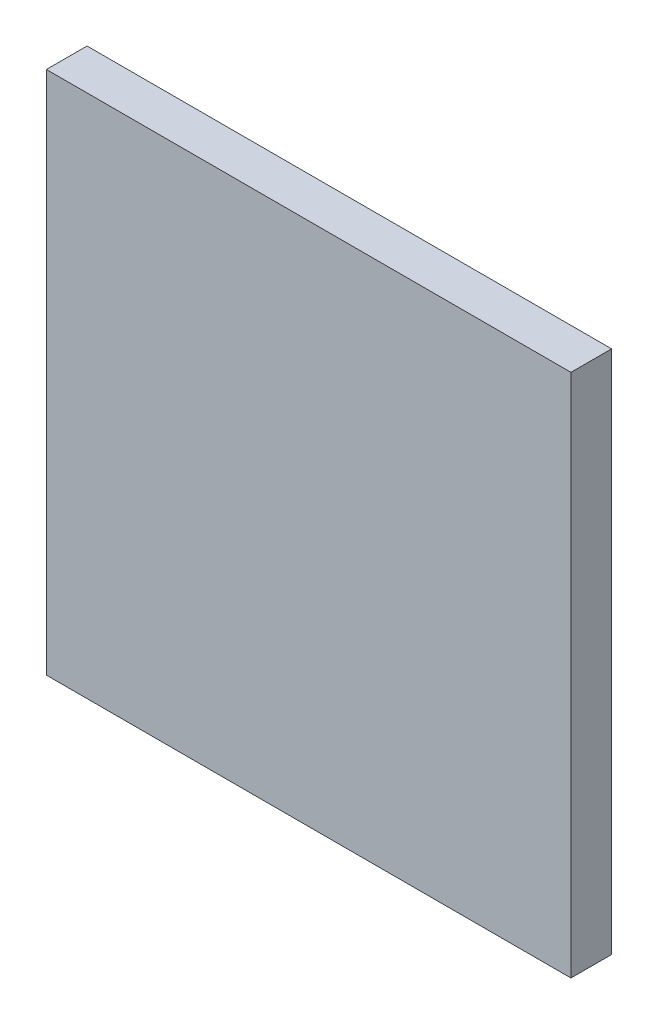
ISO-10303-21;
HEADER;
FILE_DESCRIPTION(('STEP AP214'),'2;1');
FILE_NAME('part.step','',(''),(''),'','','');
FILE_SCHEMA(('AUTOMOTIVE_DESIGN { 1 0 10303 214 1 1 1 1 }'));
ENDSEC;
DATA;
#1=APPLICATION_CONTEXT('core data for automotive mechanical design processes');
#2=APPLICATION_PROTOCOL_DEFINITION('international standard','automotive_design',2000,#1);
#3=PRODUCT_CONTEXT('',#1,'mechanical');
#4=PRODUCT('Part','Part','',(#3));
#5=PRODUCT_RELATED_PRODUCT_CATEGORY('part','',(#4));
#6=PRODUCT_DEFINITION_FORMATION('','',#4);
#7=PRODUCT_DEFINITION_CONTEXT('part definition',#1,'design');
#8=PRODUCT_DEFINITION('design','',#6,#7);
#9=PRODUCT_DEFINITION_SHAPE('','',#8);
#10=(LENGTH_UNIT() NAMED_UNIT(*) SI_UNIT(.MILLI.,.METRE.));
#11=(NAMED_UNIT(*) PLANE_ANGLE_UNIT() SI_UNIT($,.RADIAN.));
#12=(NAMED_UNIT(*) SI_UNIT($,.STERADIAN.) SOLID_ANGLE_UNIT());
#13=UNCERTAINTY_MEASURE_WITH_UNIT(LENGTH_MEASURE(1.E-05),#10,'distance_accuracy_value','');
#14=(GEOMETRIC_REPRESENTATION_CONTEXT(3) GLOBAL_UNCERTAINTY_ASSIGNED_CONTEXT((#13)) GLOBAL_UNIT_ASSIGNED_CONTEXT((#10,
#11,#12)) REPRESENTATION_CONTEXT('',''));
#15=CARTESIAN_POINT('',(0.,0.,0.));
#16=DIRECTION('',(0.,0.,1.));
#17=DIRECTION('',(1.,0.,0.));
#18=AXIS2_PLACEMENT_3D('',#15,#16,#17);
#19=CARTESIAN_POINT('',(-10.00000032,-10.00000032,1.54999944));
#20=DIRECTION('',(0.,0.,1.));
#21=DIRECTION('',(1.,0.,0.));
#22=AXIS2_PLACEMENT_3D('',#19,#20,#21);
#23=PLANE('',#22);
#24=DIRECTION('',(1.,0.,0.));
#25=VECTOR('',#24,1.);
#26=CARTESIAN_POINT('',(-10.00000032,10.00000032,1.54999944));
#27=LINE('',#26,#25);
#28=CARTESIAN_POINT('',(-10.00000032,10.00000032,1.54999944));
#29=VERTEX_POINT('',#28);
#30=CARTESIAN_POINT('',(10.00000032,10.00000032,1.54999944));
#31=VERTEX_POINT('',#30);
#32=EDGE_CURVE('E52',#29,#31,#27,.T.);
#33=ORIENTED_EDGE('',*,*,#32,.F.);
#34=DIRECTION('',(0.,1.,0.));
#35=VECTOR('',#34,1.);
#36=CARTESIAN_POINT('',(-10.00000032,-10.00000032,1.54999944));
#37=LINE('',#36,#35);
#38=CARTESIAN_POINT('',(-10.00000032,-10.00000032,1.54999944));
#39=VERTEX_POINT('',#38);
#40=EDGE_CURVE('E67',#39,#29,#37,.T.);
#41=ORIENTED_EDGE('',*,*,#40,.F.);
#42=DIRECTION('',(1.,0.,0.));
#43=VECTOR('',#42,1.);
#44=CARTESIAN_POINT('',(10.00000032,-10.00000032,1.54999944));
#45=LINE('',#44,#43);
#46=CARTESIAN_POINT('',(10.00000032,-10.00000032,1.54999944));
#47=VERTEX_POINT('',#46);
#48=EDGE_CURVE('E19',#47,#39,#45,.F.);
#49=ORIENTED_EDGE('',*,*,#48,.F.);
#50=DIRECTION('',(0.,1.,0.));
#51=VECTOR('',#50,1.);
#52=CARTESIAN_POINT('',(10.00000032,10.00000032,1.54999944));
#53=LINE('',#52,#51);
#54=EDGE_CURVE('E57',#31,#47,#53,.F.);
#55=ORIENTED_EDGE('',*,*,#54,.F.);
#56=EDGE_LOOP('',(#33,#41,#49,#55));
#57=FACE_BOUND('',#56,.T.);
#58=ADVANCED_FACE('F16',(#57),#23,.T.);
#59=CARTESIAN_POINT('',(10.00000032,-10.00000032,0.));
#60=DIRECTION('',(0.,-1.,0.));
#61=DIRECTION('',(0.,0.,-1.));
#62=AXIS2_PLACEMENT_3D('',#59,#60,#61);
#63=PLANE('',#62);
#64=DIRECTION('',(0.,0.,1.));
#65=VECTOR('',#64,1.);
#66=CARTESIAN_POINT('',(-10.00000032,-10.00000032,0.));
#67=LINE('',#66,#65);
#68=CARTESIAN_POINT('',(-10.00000032,-10.00000032,0.));
#69=VERTEX_POINT('',#68);
#70=EDGE_CURVE('E78',#69,#39,#67,.T.);
#71=ORIENTED_EDGE('',*,*,#70,.F.);
#72=DIRECTION('',(1.,0.,0.));
#73=VECTOR('',#72,1.);
#74=CARTESIAN_POINT('',(-10.00000032,-10.00000032,0.));
#75=LINE('',#74,#73);
#76=CARTESIAN_POINT('',(10.00000032,-10.00000032,0.));
#77=VERTEX_POINT('',#76);
#78=EDGE_CURVE('E73',#69,#77,#75,.T.);
#79=ORIENTED_EDGE('',*,*,#78,.T.);
#80=DIRECTION('',(0.,0.,-1.));
#81=VECTOR('',#80,1.);
#82=CARTESIAN_POINT('',(10.00000032,-10.00000032,0.));
#83=LINE('',#82,#81);
#84=EDGE_CURVE('E62',#47,#77,#83,.T.);
#85=ORIENTED_EDGE('',*,*,#84,.F.);
#86=ORIENTED_EDGE('',*,*,#48,.T.);
#87=EDGE_LOOP('',(#71,#79,#85,#86));
#88=FACE_BOUND('',#87,.T.);
#89=ADVANCED_FACE('F72',(#88),#63,.T.);
#90=CARTESIAN_POINT('',(10.00000032,10.00000032,0.));
#91=DIRECTION('',(1.,0.,0.));
#92=DIRECTION('',(0.,0.,-1.));
#93=AXIS2_PLACEMENT_3D('',#90,#91,#92);
#94=PLANE('',#93);
#95=ORIENTED_EDGE('',*,*,#84,.T.);
#96=DIRECTION('',(0.,1.,0.));
#97=VECTOR('',#96,1.);
#98=CARTESIAN_POINT('',(10.00000032,-10.00000032,0.));
#99=LINE('',#98,#97);
#100=CARTESIAN_POINT('',(10.00000032,10.00000032,0.));
#101=VERTEX_POINT('',#100);
#102=EDGE_CURVE('E83',#77,#101,#99,.T.);
#103=ORIENTED_EDGE('',*,*,#102,.T.);
#104=DIRECTION('',(0.,0.,1.));
#105=VECTOR('',#104,1.);
#106=CARTESIAN_POINT('',(10.00000032,10.00000032,0.));
#107=LINE('',#106,#105);
#108=EDGE_CURVE('E64',#31,#101,#107,.F.);
#109=ORIENTED_EDGE('',*,*,#108,.F.);
#110=ORIENTED_EDGE('',*,*,#54,.T.);
#111=EDGE_LOOP('',(#95,#103,#109,#110));
#112=FACE_BOUND('',#111,.T.);
#113=ADVANCED_FACE('F59',(#112),#94,.T.);
#114=CARTESIAN_POINT('',(-10.00000032,10.00000032,0.));
#115=DIRECTION('',(0.,1.,0.));
#116=DIRECTION('',(0.,0.,1.));
#117=AXIS2_PLACEMENT_3D('',#114,#115,#116);
#118=PLANE('',#117);
#119=ORIENTED_EDGE('',*,*,#108,.T.);
#120=DIRECTION('',(1.,0.,0.));
#121=VECTOR('',#120,1.);
#122=CARTESIAN_POINT('',(-10.00000032,10.00000032,0.));
#123=LINE('',#122,#121);
#124=CARTESIAN_POINT('',(-10.00000032,10.00000032,0.));
#125=VERTEX_POINT('',#124);
#126=EDGE_CURVE('E25',#101,#125,#123,.F.);
#127=ORIENTED_EDGE('',*,*,#126,.T.);
#128=DIRECTION('',(0.,0.,1.));
#129=VECTOR('',#128,1.);
#130=CARTESIAN_POINT('',(-10.00000032,10.00000032,0.));
#131=LINE('',#130,#129);
#132=EDGE_CURVE('E33',#29,#125,#131,.F.);
#133=ORIENTED_EDGE('',*,*,#132,.F.);
#134=ORIENTED_EDGE('',*,*,#32,.T.);
#135=EDGE_LOOP('',(#119,#127,#133,#134));
#136=FACE_BOUND('',#135,.T.);
#137=ADVANCED_FACE('F87',(#136),#118,.T.);
#138=CARTESIAN_POINT('',(-10.00000032,-10.00000032,0.));
#139=DIRECTION('',(-1.,0.,0.));
#140=DIRECTION('',(0.,0.,1.));
#141=AXIS2_PLACEMENT_3D('',#138,#139,#140);
#142=PLANE('',#141);
#143=ORIENTED_EDGE('',*,*,#132,.T.);
#144=DIRECTION('',(0.,1.,0.));
#145=VECTOR('',#144,1.);
#146=CARTESIAN_POINT('',(-10.00000032,-10.00000032,0.));
#147=LINE('',#146,#145);
#148=EDGE_CURVE('E11',#125,#69,#147,.F.);
#149=ORIENTED_EDGE('',*,*,#148,.T.);
#150=ORIENTED_EDGE('',*,*,#70,.T.);
#151=ORIENTED_EDGE('',*,*,#40,.T.);
#152=EDGE_LOOP('',(#143,#149,#150,#151));
#153=FACE_BOUND('',#152,.T.);
#154=ADVANCED_FACE('F90',(#153),#142,.T.);
#155=CARTESIAN_POINT('',(-10.00000032,-10.00000032,0.));
#156=DIRECTION('',(0.,0.,1.));
#157=DIRECTION('',(1.,0.,0.));
#158=AXIS2_PLACEMENT_3D('',#155,#156,#157);
#159=PLANE('',#158);
#160=ORIENTED_EDGE('',*,*,#126,.F.);
#161=ORIENTED_EDGE('',*,*,#102,.F.);
#162=ORIENTED_EDGE('',*,*,#78,.F.);
#163=ORIENTED_EDGE('',*,*,#148,.F.);
#164=EDGE_LOOP('',(#160,#161,#162,#163));
#165=FACE_BOUND('',#164,.T.);
#166=ADVANCED_FACE('F89',(#165),#159,.F.);
#167=CLOSED_SHELL('',(#58,#89,#113,#137,#154,#166));
#168=MANIFOLD_SOLID_BREP('B1',#167);
#169=ADVANCED_BREP_SHAPE_REPRESENTATION('',(#18,#168),#14);
#170=SHAPE_DEFINITION_REPRESENTATION(#9,#169);
ENDSEC;
END-ISO-10303-21;
